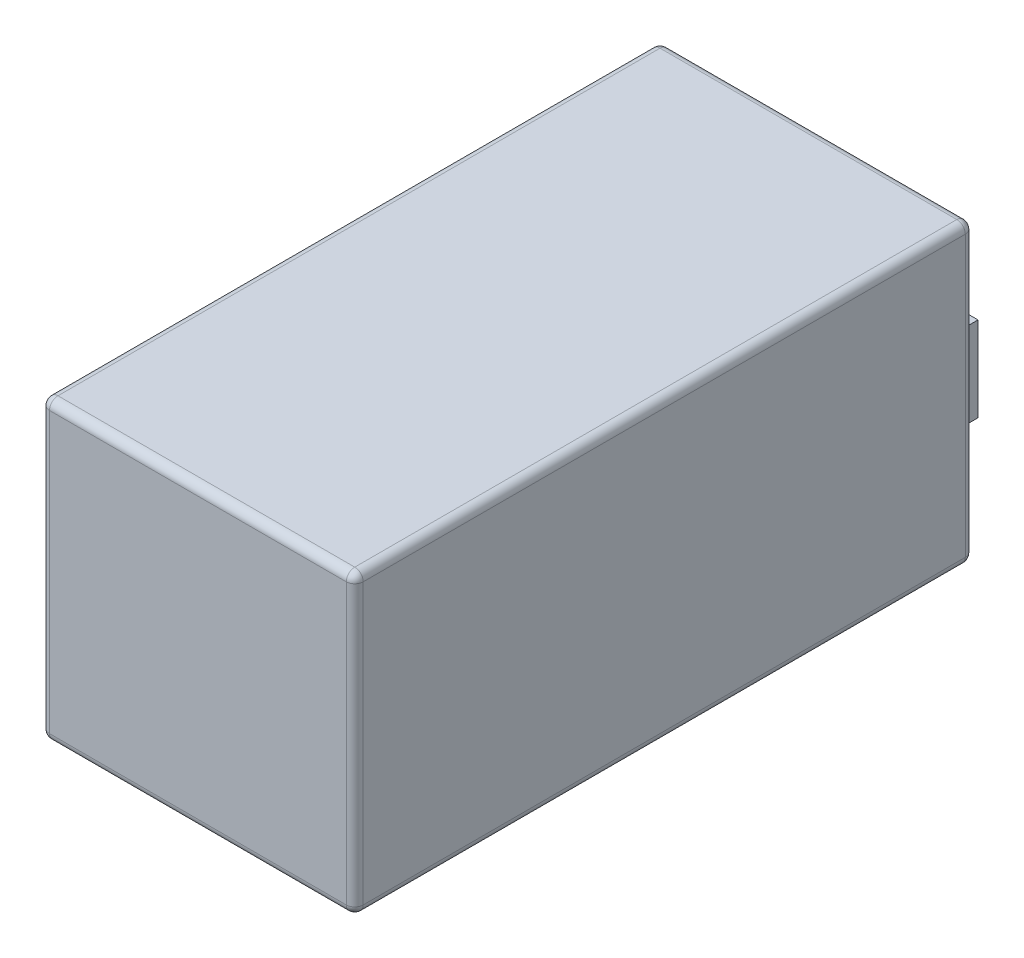
ISO-10303-21;
HEADER;
FILE_DESCRIPTION(('STEP AP214'),'2;1');
FILE_NAME('part.step','',(''),(''),'','','');
FILE_SCHEMA(('AUTOMOTIVE_DESIGN { 1 0 10303 214 1 1 1 1 }'));
ENDSEC;
DATA;
#1=APPLICATION_CONTEXT('core data for automotive mechanical design processes');
#2=APPLICATION_PROTOCOL_DEFINITION('international standard','automotive_design',2000,#1);
#3=PRODUCT_CONTEXT('',#1,'mechanical');
#4=PRODUCT('Part','Part','',(#3));
#5=PRODUCT_RELATED_PRODUCT_CATEGORY('part','',(#4));
#6=PRODUCT_DEFINITION_FORMATION('','',#4);
#7=PRODUCT_DEFINITION_CONTEXT('part definition',#1,'design');
#8=PRODUCT_DEFINITION('design','',#6,#7);
#9=PRODUCT_DEFINITION_SHAPE('','',#8);
#10=(LENGTH_UNIT() NAMED_UNIT(*) SI_UNIT(.MILLI.,.METRE.));
#11=(NAMED_UNIT(*) PLANE_ANGLE_UNIT() SI_UNIT($,.RADIAN.));
#12=(NAMED_UNIT(*) SI_UNIT($,.STERADIAN.) SOLID_ANGLE_UNIT());
#13=UNCERTAINTY_MEASURE_WITH_UNIT(LENGTH_MEASURE(1.E-05),#10,'distance_accuracy_value','');
#14=(GEOMETRIC_REPRESENTATION_CONTEXT(3) GLOBAL_UNCERTAINTY_ASSIGNED_CONTEXT((#13)) GLOBAL_UNIT_ASSIGNED_CONTEXT((#10,
#11,#12)) REPRESENTATION_CONTEXT('',''));
#15=CARTESIAN_POINT('',(0.,0.,0.));
#16=DIRECTION('',(0.,0.,1.));
#17=DIRECTION('',(1.,0.,0.));
#18=AXIS2_PLACEMENT_3D('',#15,#16,#17);
#19=CARTESIAN_POINT('',(-18.5,17.5,-36.5));
#20=DIRECTION('',(0.,0.,1.));
#21=DIRECTION('',(1.,0.,0.));
#22=AXIS2_PLACEMENT_3D('',#19,#20,#21);
#23=PLANE('',#22);
#24=DIRECTION('',(-1.,0.,0.));
#25=VECTOR('',#24,1.);
#26=CARTESIAN_POINT('',(-18.5,-16.5,-36.5));
#27=LINE('',#26,#25);
#28=CARTESIAN_POINT('',(17.5,-16.5,-36.5));
#29=VERTEX_POINT('',#28);
#30=CARTESIAN_POINT('',(-17.5,-16.5,-36.5));
#31=VERTEX_POINT('',#30);
#32=EDGE_CURVE('E206',#29,#31,#27,.T.);
#33=ORIENTED_EDGE('',*,*,#32,.T.);
#34=DIRECTION('',(0.,-1.,0.));
#35=VECTOR('',#34,1.);
#36=CARTESIAN_POINT('',(-17.5,17.5,-36.5));
#37=LINE('',#36,#35);
#38=CARTESIAN_POINT('',(-17.5,16.5,-36.5));
#39=VERTEX_POINT('',#38);
#40=EDGE_CURVE('E208',#31,#39,#37,.F.);
#41=ORIENTED_EDGE('',*,*,#40,.T.);
#42=DIRECTION('',(-1.,0.,0.));
#43=VECTOR('',#42,1.);
#44=CARTESIAN_POINT('',(-18.5,16.5,-36.5));
#45=LINE('',#44,#43);
#46=CARTESIAN_POINT('',(17.5,16.5,-36.5));
#47=VERTEX_POINT('',#46);
#48=EDGE_CURVE('E202',#39,#47,#45,.F.);
#49=ORIENTED_EDGE('',*,*,#48,.T.);
#50=DIRECTION('',(0.,-1.,0.));
#51=VECTOR('',#50,1.);
#52=CARTESIAN_POINT('',(17.5,17.5,-36.5));
#53=LINE('',#52,#51);
#54=EDGE_CURVE('E204',#47,#29,#53,.T.);
#55=ORIENTED_EDGE('',*,*,#54,.T.);
#56=EDGE_LOOP('',(#33,#41,#49,#55));
#57=FACE_BOUND('',#56,.T.);
#58=DIRECTION('',(0.,-1.,0.));
#59=VECTOR('',#58,1.);
#60=CARTESIAN_POINT('',(16.5,17.5,-36.5));
#61=LINE('',#60,#59);
#62=CARTESIAN_POINT('',(16.5,5.,-36.5));
#63=VERTEX_POINT('',#62);
#64=CARTESIAN_POINT('',(16.5,-5.,-36.5));
#65=VERTEX_POINT('',#64);
#66=EDGE_CURVE('E178',#63,#65,#61,.T.);
#67=ORIENTED_EDGE('',*,*,#66,.F.);
#68=DIRECTION('',(1.,0.,0.));
#69=VECTOR('',#68,1.);
#70=CARTESIAN_POINT('',(-18.5,5.00000000000001,-36.5));
#71=LINE('',#70,#69);
#72=CARTESIAN_POINT('',(12.5,5.,-36.5));
#73=VERTEX_POINT('',#72);
#74=EDGE_CURVE('E179',#73,#63,#71,.T.);
#75=ORIENTED_EDGE('',*,*,#74,.F.);
#76=DIRECTION('',(0.,1.,0.));
#77=VECTOR('',#76,1.);
#78=CARTESIAN_POINT('',(12.5,17.5,-36.5));
#79=LINE('',#78,#77);
#80=CARTESIAN_POINT('',(12.5,-5.,-36.5));
#81=VERTEX_POINT('',#80);
#82=EDGE_CURVE('E182',#81,#73,#79,.T.);
#83=ORIENTED_EDGE('',*,*,#82,.F.);
#84=DIRECTION('',(-1.,0.,0.));
#85=VECTOR('',#84,1.);
#86=CARTESIAN_POINT('',(-18.5,-4.99999999999999,-36.5));
#87=LINE('',#86,#85);
#88=EDGE_CURVE('E190',#65,#81,#87,.T.);
#89=ORIENTED_EDGE('',*,*,#88,.F.);
#90=EDGE_LOOP('',(#67,#75,#83,#89));
#91=FACE_BOUND('',#90,.T.);
#92=ADVANCED_FACE('F43',(#57,#91),#23,.F.);
#93=CARTESIAN_POINT('',(18.5,17.5,36.5));
#94=DIRECTION('',(-1.,0.,0.));
#95=DIRECTION('',(0.,0.,1.));
#96=AXIS2_PLACEMENT_3D('',#93,#94,#95);
#97=PLANE('',#96);
#98=DIRECTION('',(0.,-1.,0.));
#99=VECTOR('',#98,1.);
#100=CARTESIAN_POINT('',(18.5,17.5,35.5));
#101=LINE('',#100,#99);
#102=CARTESIAN_POINT('',(18.5,16.5,35.5));
#103=VERTEX_POINT('',#102);
#104=CARTESIAN_POINT('',(18.5,-16.5,35.5));
#105=VERTEX_POINT('',#104);
#106=EDGE_CURVE('E233',#103,#105,#101,.T.);
#107=ORIENTED_EDGE('',*,*,#106,.T.);
#108=DIRECTION('',(0.,0.,-1.));
#109=VECTOR('',#108,1.);
#110=CARTESIAN_POINT('',(18.5,-16.5,-36.5));
#111=LINE('',#110,#109);
#112=CARTESIAN_POINT('',(18.5,-16.5,-35.5));
#113=VERTEX_POINT('',#112);
#114=EDGE_CURVE('E236',#105,#113,#111,.T.);
#115=ORIENTED_EDGE('',*,*,#114,.T.);
#116=DIRECTION('',(0.,-1.,0.));
#117=VECTOR('',#116,1.);
#118=CARTESIAN_POINT('',(18.5,17.5,-35.5));
#119=LINE('',#118,#117);
#120=CARTESIAN_POINT('',(18.5,16.5,-35.5));
#121=VERTEX_POINT('',#120);
#122=EDGE_CURVE('E231',#113,#121,#119,.F.);
#123=ORIENTED_EDGE('',*,*,#122,.T.);
#124=DIRECTION('',(0.,0.,-1.));
#125=VECTOR('',#124,1.);
#126=CARTESIAN_POINT('',(18.5,16.5,36.5));
#127=LINE('',#126,#125);
#128=EDGE_CURVE('E229',#121,#103,#127,.F.);
#129=ORIENTED_EDGE('',*,*,#128,.T.);
#130=EDGE_LOOP('',(#107,#115,#123,#129));
#131=FACE_BOUND('',#130,.T.);
#132=ADVANCED_FACE('F352',(#131),#97,.F.);
#133=CARTESIAN_POINT('',(-18.5,17.5,36.5));
#134=DIRECTION('',(1.,0.,0.));
#135=DIRECTION('',(0.,0.,-1.));
#136=AXIS2_PLACEMENT_3D('',#133,#134,#135);
#137=PLANE('',#136);
#138=DIRECTION('',(0.,-1.,0.));
#139=VECTOR('',#138,1.);
#140=CARTESIAN_POINT('',(-18.5,17.5,-35.5));
#141=LINE('',#140,#139);
#142=CARTESIAN_POINT('',(-18.5,16.5,-35.5));
#143=VERTEX_POINT('',#142);
#144=CARTESIAN_POINT('',(-18.5,-16.5,-35.5));
#145=VERTEX_POINT('',#144);
#146=EDGE_CURVE('E197',#143,#145,#141,.T.);
#147=ORIENTED_EDGE('',*,*,#146,.T.);
#148=DIRECTION('',(0.,0.,1.));
#149=VECTOR('',#148,1.);
#150=CARTESIAN_POINT('',(-18.5,-16.5,36.5));
#151=LINE('',#150,#149);
#152=CARTESIAN_POINT('',(-18.5,-16.5,35.5));
#153=VERTEX_POINT('',#152);
#154=EDGE_CURVE('E200',#145,#153,#151,.T.);
#155=ORIENTED_EDGE('',*,*,#154,.T.);
#156=DIRECTION('',(0.,-1.,0.));
#157=VECTOR('',#156,1.);
#158=CARTESIAN_POINT('',(-18.5,17.5,35.5));
#159=LINE('',#158,#157);
#160=CARTESIAN_POINT('',(-18.5,16.5,35.5));
#161=VERTEX_POINT('',#160);
#162=EDGE_CURVE('E195',#153,#161,#159,.F.);
#163=ORIENTED_EDGE('',*,*,#162,.T.);
#164=DIRECTION('',(0.,0.,1.));
#165=VECTOR('',#164,1.);
#166=CARTESIAN_POINT('',(-18.5,16.5,36.5));
#167=LINE('',#166,#165);
#168=EDGE_CURVE('E193',#161,#143,#167,.F.);
#169=ORIENTED_EDGE('',*,*,#168,.T.);
#170=EDGE_LOOP('',(#147,#155,#163,#169));
#171=FACE_BOUND('',#170,.T.);
#172=ADVANCED_FACE('F340',(#171),#137,.F.);
#173=CARTESIAN_POINT('',(-18.5,17.5,36.5));
#174=DIRECTION('',(0.,0.,-1.));
#175=DIRECTION('',(-1.,0.,0.));
#176=AXIS2_PLACEMENT_3D('',#173,#174,#175);
#177=PLANE('',#176);
#178=DIRECTION('',(1.,0.,0.));
#179=VECTOR('',#178,1.);
#180=CARTESIAN_POINT('',(-18.5,16.5,36.5));
#181=LINE('',#180,#179);
#182=CARTESIAN_POINT('',(17.5,16.5,36.5));
#183=VERTEX_POINT('',#182);
#184=CARTESIAN_POINT('',(-17.5,16.5,36.5));
#185=VERTEX_POINT('',#184);
#186=EDGE_CURVE('E211',#183,#185,#181,.F.);
#187=ORIENTED_EDGE('',*,*,#186,.T.);
#188=DIRECTION('',(0.,-1.,0.));
#189=VECTOR('',#188,1.);
#190=CARTESIAN_POINT('',(-17.5,17.5,36.5));
#191=LINE('',#190,#189);
#192=CARTESIAN_POINT('',(-17.5,-16.5,36.5));
#193=VERTEX_POINT('',#192);
#194=EDGE_CURVE('E217',#185,#193,#191,.T.);
#195=ORIENTED_EDGE('',*,*,#194,.T.);
#196=DIRECTION('',(1.,0.,0.));
#197=VECTOR('',#196,1.);
#198=CARTESIAN_POINT('',(18.5,-16.5,36.5));
#199=LINE('',#198,#197);
#200=CARTESIAN_POINT('',(17.5,-16.5,36.5));
#201=VERTEX_POINT('',#200);
#202=EDGE_CURVE('E215',#193,#201,#199,.T.);
#203=ORIENTED_EDGE('',*,*,#202,.T.);
#204=DIRECTION('',(0.,-1.,0.));
#205=VECTOR('',#204,1.);
#206=CARTESIAN_POINT('',(17.5,17.5,36.5));
#207=LINE('',#206,#205);
#208=EDGE_CURVE('E213',#201,#183,#207,.F.);
#209=ORIENTED_EDGE('',*,*,#208,.T.);
#210=EDGE_LOOP('',(#187,#195,#203,#209));
#211=FACE_BOUND('',#210,.T.);
#212=ADVANCED_FACE('F350',(#211),#177,.F.);
#213=CARTESIAN_POINT('',(0.,17.5,0.));
#214=DIRECTION('',(0.,-1.,0.));
#215=DIRECTION('',(0.,0.,-1.));
#216=AXIS2_PLACEMENT_3D('',#213,#214,#215);
#217=PLANE('',#216);
#218=DIRECTION('',(0.,0.,1.));
#219=VECTOR('',#218,1.);
#220=CARTESIAN_POINT('',(-17.5,17.5,0.));
#221=LINE('',#220,#219);
#222=CARTESIAN_POINT('',(-17.5,17.5,-35.5));
#223=VERTEX_POINT('',#222);
#224=CARTESIAN_POINT('',(-17.5,17.5,35.5));
#225=VERTEX_POINT('',#224);
#226=EDGE_CURVE('E52',#223,#225,#221,.T.);
#227=ORIENTED_EDGE('',*,*,#226,.T.);
#228=DIRECTION('',(1.,0.,0.));
#229=VECTOR('',#228,1.);
#230=CARTESIAN_POINT('',(0.,17.5,35.5));
#231=LINE('',#230,#229);
#232=CARTESIAN_POINT('',(17.5,17.5,35.5));
#233=VERTEX_POINT('',#232);
#234=EDGE_CURVE('E11',#225,#233,#231,.T.);
#235=ORIENTED_EDGE('',*,*,#234,.T.);
#236=DIRECTION('',(0.,0.,-1.));
#237=VECTOR('',#236,1.);
#238=CARTESIAN_POINT('',(17.5,17.5,0.));
#239=LINE('',#238,#237);
#240=CARTESIAN_POINT('',(17.5,17.5,-35.5));
#241=VERTEX_POINT('',#240);
#242=EDGE_CURVE('E238',#233,#241,#239,.T.);
#243=ORIENTED_EDGE('',*,*,#242,.T.);
#244=DIRECTION('',(-1.,0.,0.));
#245=VECTOR('',#244,1.);
#246=CARTESIAN_POINT('',(0.,17.5,-35.5));
#247=LINE('',#246,#245);
#248=EDGE_CURVE('E63',#241,#223,#247,.T.);
#249=ORIENTED_EDGE('',*,*,#248,.T.);
#250=EDGE_LOOP('',(#227,#235,#243,#249));
#251=FACE_BOUND('',#250,.T.);
#252=ADVANCED_FACE('F325',(#251),#217,.F.);
#253=CARTESIAN_POINT('',(0.,-17.5,0.));
#254=DIRECTION('',(0.,-1.,0.));
#255=DIRECTION('',(0.,0.,-1.));
#256=AXIS2_PLACEMENT_3D('',#253,#254,#255);
#257=PLANE('',#256);
#258=DIRECTION('',(0.,0.,1.));
#259=VECTOR('',#258,1.);
#260=CARTESIAN_POINT('',(-17.5,-17.5,-36.5));
#261=LINE('',#260,#259);
#262=CARTESIAN_POINT('',(-17.5,-17.5,35.5));
#263=VERTEX_POINT('',#262);
#264=CARTESIAN_POINT('',(-17.5,-17.5,-35.5));
#265=VERTEX_POINT('',#264);
#266=EDGE_CURVE('E224',#263,#265,#261,.F.);
#267=ORIENTED_EDGE('',*,*,#266,.T.);
#268=DIRECTION('',(-1.,0.,0.));
#269=VECTOR('',#268,1.);
#270=CARTESIAN_POINT('',(18.5,-17.5,-35.5));
#271=LINE('',#270,#269);
#272=CARTESIAN_POINT('',(17.5,-17.5,-35.5));
#273=VERTEX_POINT('',#272);
#274=EDGE_CURVE('E226',#265,#273,#271,.F.);
#275=ORIENTED_EDGE('',*,*,#274,.T.);
#276=DIRECTION('',(0.,0.,-1.));
#277=VECTOR('',#276,1.);
#278=CARTESIAN_POINT('',(17.5,-17.5,36.5));
#279=LINE('',#278,#277);
#280=CARTESIAN_POINT('',(17.5,-17.5,35.5));
#281=VERTEX_POINT('',#280);
#282=EDGE_CURVE('E220',#273,#281,#279,.F.);
#283=ORIENTED_EDGE('',*,*,#282,.T.);
#284=DIRECTION('',(1.,0.,0.));
#285=VECTOR('',#284,1.);
#286=CARTESIAN_POINT('',(-18.5,-17.5,35.5));
#287=LINE('',#286,#285);
#288=EDGE_CURVE('E222',#281,#263,#287,.F.);
#289=ORIENTED_EDGE('',*,*,#288,.T.);
#290=EDGE_LOOP('',(#267,#275,#283,#289));
#291=FACE_BOUND('',#290,.T.);
#292=ADVANCED_FACE('F597',(#291),#257,.T.);
#293=CARTESIAN_POINT('',(16.5,-5.,-39.));
#294=DIRECTION('',(-1.,0.,0.));
#295=DIRECTION('',(0.,0.,1.));
#296=AXIS2_PLACEMENT_3D('',#293,#294,#295);
#297=PLANE('',#296);
#298=DIRECTION('',(0.,0.,1.));
#299=VECTOR('',#298,1.);
#300=CARTESIAN_POINT('',(16.5,5.,-39.));
#301=LINE('',#300,#299);
#302=CARTESIAN_POINT('',(16.5,5.,-39.));
#303=VERTEX_POINT('',#302);
#304=EDGE_CURVE('E652',#303,#63,#301,.T.);
#305=ORIENTED_EDGE('',*,*,#304,.T.);
#306=ORIENTED_EDGE('',*,*,#66,.T.);
#307=DIRECTION('',(0.,0.,1.));
#308=VECTOR('',#307,1.);
#309=CARTESIAN_POINT('',(16.5,-5.,-39.));
#310=LINE('',#309,#308);
#311=CARTESIAN_POINT('',(16.5,-5.,-39.));
#312=VERTEX_POINT('',#311);
#313=EDGE_CURVE('E160',#312,#65,#310,.T.);
#314=ORIENTED_EDGE('',*,*,#313,.F.);
#315=DIRECTION('',(0.,-1.,0.));
#316=VECTOR('',#315,1.);
#317=CARTESIAN_POINT('',(16.5,-5.,-39.));
#318=LINE('',#317,#316);
#319=EDGE_CURVE('E166',#303,#312,#318,.T.);
#320=ORIENTED_EDGE('',*,*,#319,.F.);
#321=EDGE_LOOP('',(#305,#306,#314,#320));
#322=FACE_BOUND('',#321,.T.);
#323=ADVANCED_FACE('F177',(#322),#297,.F.);
#324=CARTESIAN_POINT('',(12.5,-5.,-39.));
#325=DIRECTION('',(0.,1.,0.));
#326=DIRECTION('',(-1.,0.,0.));
#327=AXIS2_PLACEMENT_3D('',#324,#325,#326);
#328=PLANE('',#327);
#329=ORIENTED_EDGE('',*,*,#313,.T.);
#330=ORIENTED_EDGE('',*,*,#88,.T.);
#331=DIRECTION('',(0.,0.,1.));
#332=VECTOR('',#331,1.);
#333=CARTESIAN_POINT('',(12.5,-5.,-39.));
#334=LINE('',#333,#332);
#335=CARTESIAN_POINT('',(12.5,-5.,-39.));
#336=VERTEX_POINT('',#335);
#337=EDGE_CURVE('E162',#336,#81,#334,.T.);
#338=ORIENTED_EDGE('',*,*,#337,.F.);
#339=DIRECTION('',(-1.,0.,0.));
#340=VECTOR('',#339,1.);
#341=CARTESIAN_POINT('',(12.5,-5.,-39.));
#342=LINE('',#341,#340);
#343=EDGE_CURVE('E155',#312,#336,#342,.T.);
#344=ORIENTED_EDGE('',*,*,#343,.F.);
#345=EDGE_LOOP('',(#329,#330,#338,#344));
#346=FACE_BOUND('',#345,.T.);
#347=ADVANCED_FACE('F157',(#346),#328,.F.);
#348=CARTESIAN_POINT('',(12.5,-5.,-39.));
#349=DIRECTION('',(1.,0.,0.));
#350=DIRECTION('',(0.,0.,-1.));
#351=AXIS2_PLACEMENT_3D('',#348,#349,#350);
#352=PLANE('',#351);
#353=ORIENTED_EDGE('',*,*,#337,.T.);
#354=ORIENTED_EDGE('',*,*,#82,.T.);
#355=DIRECTION('',(0.,0.,1.));
#356=VECTOR('',#355,1.);
#357=CARTESIAN_POINT('',(12.5,5.,-39.));
#358=LINE('',#357,#356);
#359=CARTESIAN_POINT('',(12.5,5.,-39.));
#360=VERTEX_POINT('',#359);
#361=EDGE_CURVE('E184',#360,#73,#358,.T.);
#362=ORIENTED_EDGE('',*,*,#361,.F.);
#363=DIRECTION('',(0.,1.,0.));
#364=VECTOR('',#363,1.);
#365=CARTESIAN_POINT('',(12.5,-5.,-39.));
#366=LINE('',#365,#364);
#367=EDGE_CURVE('E165',#336,#360,#366,.T.);
#368=ORIENTED_EDGE('',*,*,#367,.F.);
#369=EDGE_LOOP('',(#353,#354,#362,#368));
#370=FACE_BOUND('',#369,.T.);
#371=ADVANCED_FACE('F574',(#370),#352,.F.);
#372=CARTESIAN_POINT('',(12.5,5.,-39.));
#373=DIRECTION('',(0.,-1.,0.));
#374=DIRECTION('',(1.,0.,0.));
#375=AXIS2_PLACEMENT_3D('',#372,#373,#374);
#376=PLANE('',#375);
#377=ORIENTED_EDGE('',*,*,#361,.T.);
#378=ORIENTED_EDGE('',*,*,#74,.T.);
#379=ORIENTED_EDGE('',*,*,#304,.F.);
#380=DIRECTION('',(1.,0.,0.));
#381=VECTOR('',#380,1.);
#382=CARTESIAN_POINT('',(12.5,5.,-39.));
#383=LINE('',#382,#381);
#384=EDGE_CURVE('E171',#360,#303,#383,.T.);
#385=ORIENTED_EDGE('',*,*,#384,.F.);
#386=EDGE_LOOP('',(#377,#378,#379,#385));
#387=FACE_BOUND('',#386,.T.);
#388=ADVANCED_FACE('F566',(#387),#376,.F.);
#389=CARTESIAN_POINT('',(0.,0.,-39.));
#390=DIRECTION('',(0.,0.,-1.));
#391=DIRECTION('',(-1.,0.,0.));
#392=AXIS2_PLACEMENT_3D('',#389,#390,#391);
#393=PLANE('',#392);
#394=ORIENTED_EDGE('',*,*,#319,.T.);
#395=ORIENTED_EDGE('',*,*,#343,.T.);
#396=ORIENTED_EDGE('',*,*,#367,.T.);
#397=ORIENTED_EDGE('',*,*,#384,.T.);
#398=EDGE_LOOP('',(#394,#395,#396,#397));
#399=FACE_BOUND('',#398,.T.);
#400=ADVANCED_FACE('F169',(#399),#393,.T.);
#401=CARTESIAN_POINT('',(17.5,17.5,35.5));
#402=DIRECTION('',(0.,-1.,0.));
#403=DIRECTION('',(0.,0.,-1.));
#404=AXIS2_PLACEMENT_3D('',#401,#402,#403);
#405=CYLINDRICAL_SURFACE('',#404,1.);
#406=CARTESIAN_POINT('',(17.5,16.5,35.5));
#407=DIRECTION('',(0.,1.,0.));
#408=DIRECTION('',(0.,0.,1.));
#409=AXIS2_PLACEMENT_3D('',#406,#407,#408);
#410=CIRCLE('',#409,1.);
#411=EDGE_CURVE('E47',#183,#103,#410,.T.);
#412=ORIENTED_EDGE('',*,*,#411,.F.);
#413=ORIENTED_EDGE('',*,*,#208,.F.);
#414=CARTESIAN_POINT('',(17.5,-16.5,35.5));
#415=DIRECTION('',(0.,-1.,0.));
#416=DIRECTION('',(0.,0.,-1.));
#417=AXIS2_PLACEMENT_3D('',#414,#415,#416);
#418=CIRCLE('',#417,1.);
#419=EDGE_CURVE('E303',#105,#201,#418,.T.);
#420=ORIENTED_EDGE('',*,*,#419,.F.);
#421=ORIENTED_EDGE('',*,*,#106,.F.);
#422=EDGE_LOOP('',(#412,#413,#420,#421));
#423=FACE_BOUND('',#422,.T.);
#424=ADVANCED_FACE('F45',(#423),#405,.T.);
#425=CARTESIAN_POINT('',(17.5,16.5,35.5));
#426=DIRECTION('',(1.,0.,0.));
#427=DIRECTION('',(0.,0.,-1.));
#428=AXIS2_PLACEMENT_3D('',#425,#426,#427);
#429=SPHERICAL_SURFACE('',#428,1.);
#430=CARTESIAN_POINT('',(17.5,16.5,35.5));
#431=DIRECTION('',(1.,0.,0.));
#432=DIRECTION('',(0.,0.,-1.));
#433=AXIS2_PLACEMENT_3D('',#430,#431,#432);
#434=CIRCLE('',#433,1.);
#435=EDGE_CURVE('E298',#183,#233,#434,.F.);
#436=ORIENTED_EDGE('',*,*,#435,.F.);
#437=ORIENTED_EDGE('',*,*,#411,.T.);
#438=CARTESIAN_POINT('',(17.5,16.5,35.5));
#439=DIRECTION('',(0.,0.,1.));
#440=DIRECTION('',(1.,0.,0.));
#441=AXIS2_PLACEMENT_3D('',#438,#439,#440);
#442=CIRCLE('',#441,1.);
#443=EDGE_CURVE('E301',#233,#103,#442,.F.);
#444=ORIENTED_EDGE('',*,*,#443,.F.);
#445=EDGE_LOOP('',(#436,#437,#444));
#446=FACE_BOUND('',#445,.T.);
#447=ADVANCED_FACE('F314',(#446),#429,.T.);
#448=CARTESIAN_POINT('',(17.5,-16.5,35.5));
#449=DIRECTION('',(0.,0.,1.));
#450=DIRECTION('',(1.,0.,0.));
#451=AXIS2_PLACEMENT_3D('',#448,#449,#450);
#452=SPHERICAL_SURFACE('',#451,1.);
#453=CARTESIAN_POINT('',(17.5,-16.5,35.5));
#454=DIRECTION('',(0.,0.,1.));
#455=DIRECTION('',(1.,0.,0.));
#456=AXIS2_PLACEMENT_3D('',#453,#454,#455);
#457=CIRCLE('',#456,1.);
#458=EDGE_CURVE('E292',#105,#281,#457,.F.);
#459=ORIENTED_EDGE('',*,*,#458,.F.);
#460=ORIENTED_EDGE('',*,*,#419,.T.);
#461=CARTESIAN_POINT('',(17.5,-16.5,35.5));
#462=DIRECTION('',(1.,0.,0.));
#463=DIRECTION('',(0.,0.,-1.));
#464=AXIS2_PLACEMENT_3D('',#461,#462,#463);
#465=CIRCLE('',#464,1.);
#466=EDGE_CURVE('E295',#281,#201,#465,.F.);
#467=ORIENTED_EDGE('',*,*,#466,.F.);
#468=EDGE_LOOP('',(#459,#460,#467));
#469=FACE_BOUND('',#468,.T.);
#470=ADVANCED_FACE('F396',(#469),#452,.T.);
#471=CARTESIAN_POINT('',(17.5,16.5,0.));
#472=DIRECTION('',(0.,0.,-1.));
#473=DIRECTION('',(-1.,0.,0.));
#474=AXIS2_PLACEMENT_3D('',#471,#472,#473);
#475=CYLINDRICAL_SURFACE('',#474,1.);
#476=ORIENTED_EDGE('',*,*,#443,.T.);
#477=ORIENTED_EDGE('',*,*,#128,.F.);
#478=CARTESIAN_POINT('',(17.5,16.5,-35.5));
#479=DIRECTION('',(0.,0.,-1.));
#480=DIRECTION('',(-1.,0.,0.));
#481=AXIS2_PLACEMENT_3D('',#478,#479,#480);
#482=CIRCLE('',#481,1.);
#483=EDGE_CURVE('E286',#241,#121,#482,.T.);
#484=ORIENTED_EDGE('',*,*,#483,.F.);
#485=ORIENTED_EDGE('',*,*,#242,.F.);
#486=EDGE_LOOP('',(#476,#477,#484,#485));
#487=FACE_BOUND('',#486,.T.);
#488=ADVANCED_FACE('F321',(#487),#475,.T.);
#489=CARTESIAN_POINT('',(0.,16.5,35.5));
#490=DIRECTION('',(1.,0.,0.));
#491=DIRECTION('',(0.,0.,-1.));
#492=AXIS2_PLACEMENT_3D('',#489,#490,#491);
#493=CYLINDRICAL_SURFACE('',#492,1.);
#494=ORIENTED_EDGE('',*,*,#435,.T.);
#495=ORIENTED_EDGE('',*,*,#234,.F.);
#496=CARTESIAN_POINT('',(-17.5,16.5,35.5));
#497=DIRECTION('',(-1.,0.,0.));
#498=DIRECTION('',(0.,0.,1.));
#499=AXIS2_PLACEMENT_3D('',#496,#497,#498);
#500=CIRCLE('',#499,1.);
#501=EDGE_CURVE('E283',#185,#225,#500,.T.);
#502=ORIENTED_EDGE('',*,*,#501,.F.);
#503=ORIENTED_EDGE('',*,*,#186,.F.);
#504=EDGE_LOOP('',(#494,#495,#502,#503));
#505=FACE_BOUND('',#504,.T.);
#506=ADVANCED_FACE('F328',(#505),#493,.T.);
#507=CARTESIAN_POINT('',(-17.5,17.5,35.5));
#508=DIRECTION('',(0.,-1.,0.));
#509=DIRECTION('',(0.,0.,-1.));
#510=AXIS2_PLACEMENT_3D('',#507,#508,#509);
#511=CYLINDRICAL_SURFACE('',#510,1.);
#512=CARTESIAN_POINT('',(-17.5,-16.5,35.5));
#513=DIRECTION('',(0.,-1.,0.));
#514=DIRECTION('',(0.,0.,-1.));
#515=AXIS2_PLACEMENT_3D('',#512,#513,#514);
#516=CIRCLE('',#515,1.);
#517=EDGE_CURVE('E277',#193,#153,#516,.T.);
#518=ORIENTED_EDGE('',*,*,#517,.F.);
#519=ORIENTED_EDGE('',*,*,#194,.F.);
#520=CARTESIAN_POINT('',(-17.5,16.5,35.5));
#521=DIRECTION('',(0.,1.,0.));
#522=DIRECTION('',(0.,0.,1.));
#523=AXIS2_PLACEMENT_3D('',#520,#521,#522);
#524=CIRCLE('',#523,1.);
#525=EDGE_CURVE('E280',#161,#185,#524,.T.);
#526=ORIENTED_EDGE('',*,*,#525,.F.);
#527=ORIENTED_EDGE('',*,*,#162,.F.);
#528=EDGE_LOOP('',(#518,#519,#526,#527));
#529=FACE_BOUND('',#528,.T.);
#530=ADVANCED_FACE('F347',(#529),#511,.T.);
#531=CARTESIAN_POINT('',(-18.5,-16.5,35.5));
#532=DIRECTION('',(-1.,0.,0.));
#533=DIRECTION('',(0.,0.,1.));
#534=AXIS2_PLACEMENT_3D('',#531,#532,#533);
#535=CYLINDRICAL_SURFACE('',#534,1.);
#536=ORIENTED_EDGE('',*,*,#466,.T.);
#537=ORIENTED_EDGE('',*,*,#202,.F.);
#538=CARTESIAN_POINT('',(-17.5,-16.5,35.5));
#539=DIRECTION('',(-1.,0.,0.));
#540=DIRECTION('',(0.,0.,1.));
#541=AXIS2_PLACEMENT_3D('',#538,#539,#540);
#542=CIRCLE('',#541,1.);
#543=EDGE_CURVE('E275',#263,#193,#542,.T.);
#544=ORIENTED_EDGE('',*,*,#543,.F.);
#545=ORIENTED_EDGE('',*,*,#288,.F.);
#546=EDGE_LOOP('',(#536,#537,#544,#545));
#547=FACE_BOUND('',#546,.T.);
#548=ADVANCED_FACE('F395',(#547),#535,.T.);
#549=CARTESIAN_POINT('',(17.5,-16.5,36.5));
#550=DIRECTION('',(0.,0.,1.));
#551=DIRECTION('',(1.,0.,0.));
#552=AXIS2_PLACEMENT_3D('',#549,#550,#551);
#553=CYLINDRICAL_SURFACE('',#552,1.);
#554=ORIENTED_EDGE('',*,*,#458,.T.);
#555=ORIENTED_EDGE('',*,*,#282,.F.);
#556=CARTESIAN_POINT('',(17.5,-16.5,-35.5));
#557=DIRECTION('',(0.,0.,-1.));
#558=DIRECTION('',(-1.,0.,0.));
#559=AXIS2_PLACEMENT_3D('',#556,#557,#558);
#560=CIRCLE('',#559,1.);
#561=EDGE_CURVE('E272',#113,#273,#560,.T.);
#562=ORIENTED_EDGE('',*,*,#561,.F.);
#563=ORIENTED_EDGE('',*,*,#114,.F.);
#564=EDGE_LOOP('',(#554,#555,#562,#563));
#565=FACE_BOUND('',#564,.T.);
#566=ADVANCED_FACE('F362',(#565),#553,.T.);
#567=CARTESIAN_POINT('',(17.5,17.5,-35.5));
#568=DIRECTION('',(0.,-1.,0.));
#569=DIRECTION('',(0.,0.,-1.));
#570=AXIS2_PLACEMENT_3D('',#567,#568,#569);
#571=CYLINDRICAL_SURFACE('',#570,1.);
#572=CARTESIAN_POINT('',(17.5,16.5,-35.5));
#573=DIRECTION('',(0.,1.,0.));
#574=DIRECTION('',(0.,0.,1.));
#575=AXIS2_PLACEMENT_3D('',#572,#573,#574);
#576=CIRCLE('',#575,1.);
#577=EDGE_CURVE('E289',#121,#47,#576,.T.);
#578=ORIENTED_EDGE('',*,*,#577,.F.);
#579=ORIENTED_EDGE('',*,*,#122,.F.);
#580=CARTESIAN_POINT('',(17.5,-16.5,-35.5));
#581=DIRECTION('',(0.,-1.,0.));
#582=DIRECTION('',(0.,0.,-1.));
#583=AXIS2_PLACEMENT_3D('',#580,#581,#582);
#584=CIRCLE('',#583,1.);
#585=EDGE_CURVE('E269',#29,#113,#584,.T.);
#586=ORIENTED_EDGE('',*,*,#585,.F.);
#587=ORIENTED_EDGE('',*,*,#54,.F.);
#588=EDGE_LOOP('',(#578,#579,#586,#587));
#589=FACE_BOUND('',#588,.T.);
#590=ADVANCED_FACE('F357',(#589),#571,.T.);
#591=CARTESIAN_POINT('',(17.5,16.5,-35.5));
#592=DIRECTION('',(1.,0.,0.));
#593=DIRECTION('',(0.,0.,-1.));
#594=AXIS2_PLACEMENT_3D('',#591,#592,#593);
#595=SPHERICAL_SURFACE('',#594,1.);
#596=ORIENTED_EDGE('',*,*,#483,.T.);
#597=ORIENTED_EDGE('',*,*,#577,.T.);
#598=CARTESIAN_POINT('',(17.5,16.5,-35.5));
#599=DIRECTION('',(1.,0.,0.));
#600=DIRECTION('',(0.,0.,-1.));
#601=AXIS2_PLACEMENT_3D('',#598,#599,#600);
#602=CIRCLE('',#601,1.);
#603=EDGE_CURVE('E266',#241,#47,#602,.F.);
#604=ORIENTED_EDGE('',*,*,#603,.F.);
#605=EDGE_LOOP('',(#596,#597,#604));
#606=FACE_BOUND('',#605,.T.);
#607=ADVANCED_FACE('F375',(#606),#595,.T.);
#608=CARTESIAN_POINT('',(-17.5,16.5,35.5));
#609=DIRECTION('',(0.,0.,1.));
#610=DIRECTION('',(1.,0.,0.));
#611=AXIS2_PLACEMENT_3D('',#608,#609,#610);
#612=SPHERICAL_SURFACE('',#611,1.);
#613=ORIENTED_EDGE('',*,*,#525,.T.);
#614=ORIENTED_EDGE('',*,*,#501,.T.);
#615=CARTESIAN_POINT('',(-17.5,16.5,35.5));
#616=DIRECTION('',(0.,0.,1.));
#617=DIRECTION('',(1.,0.,0.));
#618=AXIS2_PLACEMENT_3D('',#615,#616,#617);
#619=CIRCLE('',#618,1.);
#620=EDGE_CURVE('E263',#161,#225,#619,.F.);
#621=ORIENTED_EDGE('',*,*,#620,.F.);
#622=EDGE_LOOP('',(#613,#614,#621));
#623=FACE_BOUND('',#622,.T.);
#624=ADVANCED_FACE('F331',(#623),#612,.T.);
#625=CARTESIAN_POINT('',(-17.5,-16.5,35.5));
#626=DIRECTION('',(0.,0.,1.));
#627=DIRECTION('',(1.,0.,0.));
#628=AXIS2_PLACEMENT_3D('',#625,#626,#627);
#629=SPHERICAL_SURFACE('',#628,1.);
#630=ORIENTED_EDGE('',*,*,#543,.T.);
#631=ORIENTED_EDGE('',*,*,#517,.T.);
#632=CARTESIAN_POINT('',(-17.5,-16.5,35.5));
#633=DIRECTION('',(0.,0.,1.));
#634=DIRECTION('',(1.,0.,0.));
#635=AXIS2_PLACEMENT_3D('',#632,#633,#634);
#636=CIRCLE('',#635,1.);
#637=EDGE_CURVE('E260',#263,#153,#636,.F.);
#638=ORIENTED_EDGE('',*,*,#637,.F.);
#639=EDGE_LOOP('',(#630,#631,#638));
#640=FACE_BOUND('',#639,.T.);
#641=ADVANCED_FACE('F391',(#640),#629,.T.);
#642=CARTESIAN_POINT('',(17.5,-16.5,-35.5));
#643=DIRECTION('',(1.,0.,0.));
#644=DIRECTION('',(0.,0.,-1.));
#645=AXIS2_PLACEMENT_3D('',#642,#643,#644);
#646=SPHERICAL_SURFACE('',#645,1.);
#647=ORIENTED_EDGE('',*,*,#585,.T.);
#648=ORIENTED_EDGE('',*,*,#561,.T.);
#649=CARTESIAN_POINT('',(17.5,-16.5,-35.5));
#650=DIRECTION('',(1.,0.,0.));
#651=DIRECTION('',(0.,0.,-1.));
#652=AXIS2_PLACEMENT_3D('',#649,#650,#651);
#653=CIRCLE('',#652,1.);
#654=EDGE_CURVE('E258',#29,#273,#653,.F.);
#655=ORIENTED_EDGE('',*,*,#654,.F.);
#656=EDGE_LOOP('',(#647,#648,#655));
#657=FACE_BOUND('',#656,.T.);
#658=ADVANCED_FACE('F364',(#657),#646,.T.);
#659=CARTESIAN_POINT('',(0.,16.5,-35.5));
#660=DIRECTION('',(-1.,0.,0.));
#661=DIRECTION('',(0.,0.,1.));
#662=AXIS2_PLACEMENT_3D('',#659,#660,#661);
#663=CYLINDRICAL_SURFACE('',#662,1.);
#664=ORIENTED_EDGE('',*,*,#603,.T.);
#665=ORIENTED_EDGE('',*,*,#48,.F.);
#666=CARTESIAN_POINT('',(-17.5,16.5,-35.5));
#667=DIRECTION('',(-1.,0.,0.));
#668=DIRECTION('',(0.,0.,1.));
#669=AXIS2_PLACEMENT_3D('',#666,#667,#668);
#670=CIRCLE('',#669,1.);
#671=EDGE_CURVE('E255',#223,#39,#670,.T.);
#672=ORIENTED_EDGE('',*,*,#671,.F.);
#673=ORIENTED_EDGE('',*,*,#248,.F.);
#674=EDGE_LOOP('',(#664,#665,#672,#673));
#675=FACE_BOUND('',#674,.T.);
#676=ADVANCED_FACE('F377',(#675),#663,.T.);
#677=CARTESIAN_POINT('',(-17.5,16.5,0.));
#678=DIRECTION('',(0.,0.,1.));
#679=DIRECTION('',(1.,0.,0.));
#680=AXIS2_PLACEMENT_3D('',#677,#678,#679);
#681=CYLINDRICAL_SURFACE('',#680,1.);
#682=ORIENTED_EDGE('',*,*,#620,.T.);
#683=ORIENTED_EDGE('',*,*,#226,.F.);
#684=CARTESIAN_POINT('',(-17.5,16.5,-35.5));
#685=DIRECTION('',(0.,0.,-1.));
#686=DIRECTION('',(-1.,0.,0.));
#687=AXIS2_PLACEMENT_3D('',#684,#685,#686);
#688=CIRCLE('',#687,1.);
#689=EDGE_CURVE('E252',#143,#223,#688,.T.);
#690=ORIENTED_EDGE('',*,*,#689,.F.);
#691=ORIENTED_EDGE('',*,*,#168,.F.);
#692=EDGE_LOOP('',(#682,#683,#690,#691));
#693=FACE_BOUND('',#692,.T.);
#694=ADVANCED_FACE('F335',(#693),#681,.T.);
#695=CARTESIAN_POINT('',(-17.5,-16.5,36.5));
#696=DIRECTION('',(0.,0.,-1.));
#697=DIRECTION('',(-1.,0.,0.));
#698=AXIS2_PLACEMENT_3D('',#695,#696,#697);
#699=CYLINDRICAL_SURFACE('',#698,1.);
#700=ORIENTED_EDGE('',*,*,#637,.T.);
#701=ORIENTED_EDGE('',*,*,#154,.F.);
#702=CARTESIAN_POINT('',(-17.5,-16.5,-35.5));
#703=DIRECTION('',(0.,0.,-1.));
#704=DIRECTION('',(-1.,0.,0.));
#705=AXIS2_PLACEMENT_3D('',#702,#703,#704);
#706=CIRCLE('',#705,1.);
#707=EDGE_CURVE('E249',#265,#145,#706,.T.);
#708=ORIENTED_EDGE('',*,*,#707,.F.);
#709=ORIENTED_EDGE('',*,*,#266,.F.);
#710=EDGE_LOOP('',(#700,#701,#708,#709));
#711=FACE_BOUND('',#710,.T.);
#712=ADVANCED_FACE('F388',(#711),#699,.T.);
#713=CARTESIAN_POINT('',(-18.5,-16.5,-35.5));
#714=DIRECTION('',(1.,0.,0.));
#715=DIRECTION('',(0.,0.,-1.));
#716=AXIS2_PLACEMENT_3D('',#713,#714,#715);
#717=CYLINDRICAL_SURFACE('',#716,1.);
#718=ORIENTED_EDGE('',*,*,#654,.T.);
#719=ORIENTED_EDGE('',*,*,#274,.F.);
#720=CARTESIAN_POINT('',(-17.5,-16.5,-35.5));
#721=DIRECTION('',(-1.,0.,0.));
#722=DIRECTION('',(0.,0.,1.));
#723=AXIS2_PLACEMENT_3D('',#720,#721,#722);
#724=CIRCLE('',#723,1.);
#725=EDGE_CURVE('E246',#31,#265,#724,.T.);
#726=ORIENTED_EDGE('',*,*,#725,.F.);
#727=ORIENTED_EDGE('',*,*,#32,.F.);
#728=EDGE_LOOP('',(#718,#719,#726,#727));
#729=FACE_BOUND('',#728,.T.);
#730=ADVANCED_FACE('F369',(#729),#717,.T.);
#731=CARTESIAN_POINT('',(-17.5,16.5,-35.5));
#732=DIRECTION('',(0.,1.,0.));
#733=DIRECTION('',(0.,0.,1.));
#734=AXIS2_PLACEMENT_3D('',#731,#732,#733);
#735=SPHERICAL_SURFACE('',#734,1.);
#736=ORIENTED_EDGE('',*,*,#689,.T.);
#737=ORIENTED_EDGE('',*,*,#671,.T.);
#738=CARTESIAN_POINT('',(-17.5,16.5,-35.5));
#739=DIRECTION('',(0.,1.,0.));
#740=DIRECTION('',(0.,0.,1.));
#741=AXIS2_PLACEMENT_3D('',#738,#739,#740);
#742=CIRCLE('',#741,1.);
#743=EDGE_CURVE('E244',#143,#39,#742,.F.);
#744=ORIENTED_EDGE('',*,*,#743,.F.);
#745=EDGE_LOOP('',(#736,#737,#744));
#746=FACE_BOUND('',#745,.T.);
#747=ADVANCED_FACE('F379',(#746),#735,.T.);
#748=CARTESIAN_POINT('',(-17.5,-16.5,-35.5));
#749=DIRECTION('',(0.,-1.,0.));
#750=DIRECTION('',(0.,0.,-1.));
#751=AXIS2_PLACEMENT_3D('',#748,#749,#750);
#752=SPHERICAL_SURFACE('',#751,1.);
#753=ORIENTED_EDGE('',*,*,#725,.T.);
#754=ORIENTED_EDGE('',*,*,#707,.T.);
#755=CARTESIAN_POINT('',(-17.5,-16.5,-35.5));
#756=DIRECTION('',(0.,-1.,0.));
#757=DIRECTION('',(0.,0.,-1.));
#758=AXIS2_PLACEMENT_3D('',#755,#756,#757);
#759=CIRCLE('',#758,1.);
#760=EDGE_CURVE('E242',#31,#145,#759,.F.);
#761=ORIENTED_EDGE('',*,*,#760,.F.);
#762=EDGE_LOOP('',(#753,#754,#761));
#763=FACE_BOUND('',#762,.T.);
#764=ADVANCED_FACE('F385',(#763),#752,.T.);
#765=CARTESIAN_POINT('',(-17.5,17.5,-35.5));
#766=DIRECTION('',(0.,-1.,0.));
#767=DIRECTION('',(0.,0.,-1.));
#768=AXIS2_PLACEMENT_3D('',#765,#766,#767);
#769=CYLINDRICAL_SURFACE('',#768,1.);
#770=ORIENTED_EDGE('',*,*,#743,.T.);
#771=ORIENTED_EDGE('',*,*,#40,.F.);
#772=ORIENTED_EDGE('',*,*,#760,.T.);
#773=ORIENTED_EDGE('',*,*,#146,.F.);
#774=EDGE_LOOP('',(#770,#771,#772,#773));
#775=FACE_BOUND('',#774,.T.);
#776=ADVANCED_FACE('F381',(#775),#769,.T.);
#777=CLOSED_SHELL('',(#92,#132,#172,#212,#252,#292,#323,#347,#371,#388,#400,#424,#447,#470,#488,
#506,#530,#548,#566,#590,#607,#624,#641,#658,#676,#694,#712,#730,#747,#764,#776));
#778=MANIFOLD_SOLID_BREP('B2',#777);
#779=ADVANCED_BREP_SHAPE_REPRESENTATION('',(#18,#778),#14);
#780=SHAPE_DEFINITION_REPRESENTATION(#9,#779);
ENDSEC;
END-ISO-10303-21;
